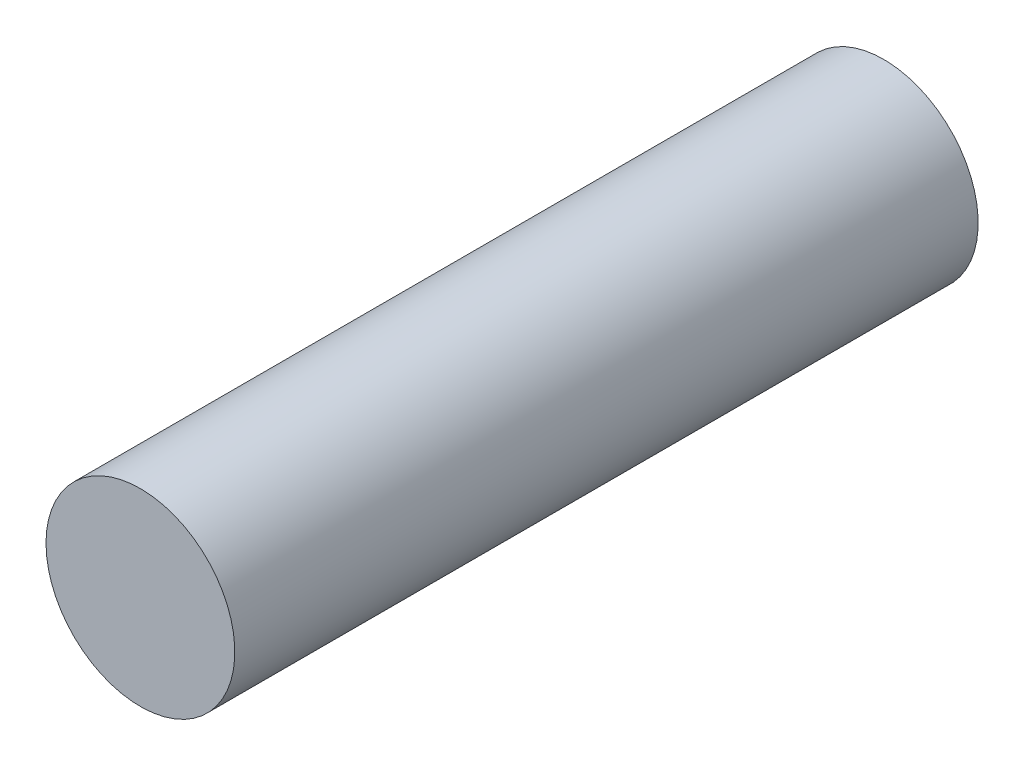
ISO-10303-21;
HEADER;
FILE_DESCRIPTION(('STEP AP214'),'2;1');
FILE_NAME('part.step','',(''),(''),'','','');
FILE_SCHEMA(('AUTOMOTIVE_DESIGN { 1 0 10303 214 1 1 1 1 }'));
ENDSEC;
DATA;
#1=APPLICATION_CONTEXT('core data for automotive mechanical design processes');
#2=APPLICATION_PROTOCOL_DEFINITION('international standard','automotive_design',2000,#1);
#3=PRODUCT_CONTEXT('',#1,'mechanical');
#4=PRODUCT('Part','Part','',(#3));
#5=PRODUCT_RELATED_PRODUCT_CATEGORY('part','',(#4));
#6=PRODUCT_DEFINITION_FORMATION('','',#4);
#7=PRODUCT_DEFINITION_CONTEXT('part definition',#1,'design');
#8=PRODUCT_DEFINITION('design','',#6,#7);
#9=PRODUCT_DEFINITION_SHAPE('','',#8);
#10=(LENGTH_UNIT() NAMED_UNIT(*) SI_UNIT(.MILLI.,.METRE.));
#11=(NAMED_UNIT(*) PLANE_ANGLE_UNIT() SI_UNIT($,.RADIAN.));
#12=(NAMED_UNIT(*) SI_UNIT($,.STERADIAN.) SOLID_ANGLE_UNIT());
#13=UNCERTAINTY_MEASURE_WITH_UNIT(LENGTH_MEASURE(1.E-05),#10,'distance_accuracy_value','');
#14=(GEOMETRIC_REPRESENTATION_CONTEXT(3) GLOBAL_UNCERTAINTY_ASSIGNED_CONTEXT((#13)) GLOBAL_UNIT_ASSIGNED_CONTEXT((#10,
#11,#12)) REPRESENTATION_CONTEXT('',''));
#15=CARTESIAN_POINT('',(0.,0.,0.));
#16=DIRECTION('',(0.,0.,1.));
#17=DIRECTION('',(1.,0.,0.));
#18=AXIS2_PLACEMENT_3D('',#15,#16,#17);
#19=CARTESIAN_POINT('',(0.,0.,1.00000000000006));
#20=DIRECTION('',(0.,0.,1.));
#21=DIRECTION('',(1.,0.,0.));
#22=AXIS2_PLACEMENT_3D('',#19,#20,#21);
#23=PLANE('',#22);
#24=CARTESIAN_POINT('',(0.,0.,1.00000000000006));
#25=DIRECTION('',(0.,0.,1.));
#26=DIRECTION('',(-1.,0.,0.));
#27=AXIS2_PLACEMENT_3D('',#24,#25,#26);
#28=CIRCLE('',#27,0.127);
#29=CARTESIAN_POINT('',(-0.127,0.,1.00000000000006));
#30=VERTEX_POINT('',#29);
#31=EDGE_CURVE('E21',#30,#30,#28,.T.);
#32=ORIENTED_EDGE('',*,*,#31,.T.);
#33=EDGE_LOOP('',(#32));
#34=FACE_BOUND('',#33,.T.);
#35=ADVANCED_FACE('F17',(#34),#23,.T.);
#36=CARTESIAN_POINT('',(0.,0.,0.));
#37=DIRECTION('',(0.,0.,1.));
#38=DIRECTION('',(1.,0.,0.));
#39=AXIS2_PLACEMENT_3D('',#36,#37,#38);
#40=CYLINDRICAL_SURFACE('',#39,0.127);
#41=ORIENTED_EDGE('',*,*,#31,.F.);
#42=DIRECTION('',(0.,0.,-1.));
#43=VECTOR('',#42,1.);
#44=CARTESIAN_POINT('',(-0.127,0.,0.));
#45=LINE('',#44,#43);
#46=CARTESIAN_POINT('',(-0.127,0.,0.));
#47=VERTEX_POINT('',#46);
#48=EDGE_CURVE('E11',#30,#47,#45,.T.);
#49=ORIENTED_EDGE('',*,*,#48,.T.);
#50=CARTESIAN_POINT('',(0.,0.,0.));
#51=DIRECTION('',(0.,0.,1.));
#52=DIRECTION('',(-1.,0.,0.));
#53=AXIS2_PLACEMENT_3D('',#50,#51,#52);
#54=CIRCLE('',#53,0.127);
#55=EDGE_CURVE('E41',#47,#47,#54,.T.);
#56=ORIENTED_EDGE('',*,*,#55,.T.);
#57=ORIENTED_EDGE('',*,*,#48,.F.);
#58=EDGE_LOOP('',(#41,#49,#56,#57));
#59=FACE_BOUND('',#58,.T.);
#60=ADVANCED_FACE('F19',(#59),#40,.T.);
#61=CARTESIAN_POINT('',(0.,0.,0.));
#62=DIRECTION('',(0.,0.,1.));
#63=DIRECTION('',(1.,0.,0.));
#64=AXIS2_PLACEMENT_3D('',#61,#62,#63);
#65=PLANE('',#64);
#66=ORIENTED_EDGE('',*,*,#55,.F.);
#67=EDGE_LOOP('',(#66));
#68=FACE_BOUND('',#67,.T.);
#69=ADVANCED_FACE('F61',(#68),#65,.F.);
#70=CLOSED_SHELL('',(#35,#60,#69));
#71=MANIFOLD_SOLID_BREP('B1',#70);
#72=ADVANCED_BREP_SHAPE_REPRESENTATION('',(#18,#71),#14);
#73=SHAPE_DEFINITION_REPRESENTATION(#9,#72);
ENDSEC;
END-ISO-10303-21;
